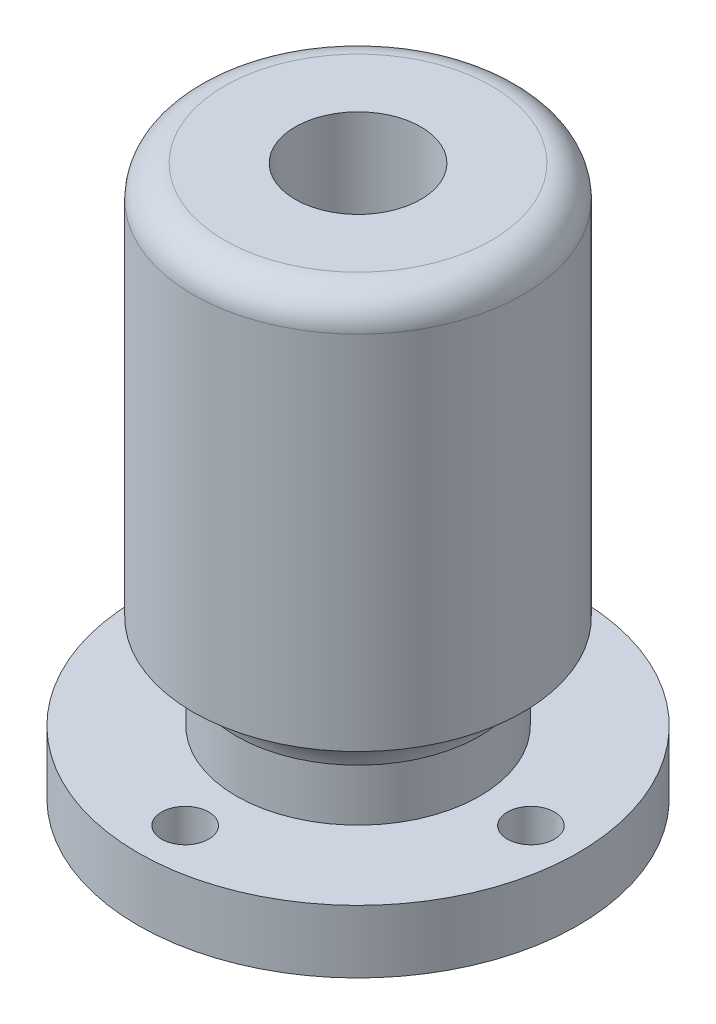
ISO-10303-21;
HEADER;
FILE_DESCRIPTION(('STEP AP214'),'2;1');
FILE_NAME('part.step','',(''),(''),'','','');
FILE_SCHEMA(('AUTOMOTIVE_DESIGN { 1 0 10303 214 1 1 1 1 }'));
ENDSEC;
DATA;
#1=APPLICATION_CONTEXT('core data for automotive mechanical design processes');
#2=APPLICATION_PROTOCOL_DEFINITION('international standard','automotive_design',2000,#1);
#3=PRODUCT_CONTEXT('',#1,'mechanical');
#4=PRODUCT('Part','Part','',(#3));
#5=PRODUCT_RELATED_PRODUCT_CATEGORY('part','',(#4));
#6=PRODUCT_DEFINITION_FORMATION('','',#4);
#7=PRODUCT_DEFINITION_CONTEXT('part definition',#1,'design');
#8=PRODUCT_DEFINITION('design','',#6,#7);
#9=PRODUCT_DEFINITION_SHAPE('','',#8);
#10=(LENGTH_UNIT() NAMED_UNIT(*) SI_UNIT(.MILLI.,.METRE.));
#11=(NAMED_UNIT(*) PLANE_ANGLE_UNIT() SI_UNIT($,.RADIAN.));
#12=(NAMED_UNIT(*) SI_UNIT($,.STERADIAN.) SOLID_ANGLE_UNIT());
#13=UNCERTAINTY_MEASURE_WITH_UNIT(LENGTH_MEASURE(1.E-05),#10,'distance_accuracy_value','');
#14=(GEOMETRIC_REPRESENTATION_CONTEXT(3) GLOBAL_UNCERTAINTY_ASSIGNED_CONTEXT((#13)) GLOBAL_UNIT_ASSIGNED_CONTEXT((#10,
#11,#12)) REPRESENTATION_CONTEXT('',''));
#15=CARTESIAN_POINT('',(0.,0.,0.));
#16=DIRECTION('',(0.,0.,1.));
#17=DIRECTION('',(1.,0.,0.));
#18=AXIS2_PLACEMENT_3D('',#15,#16,#17);
#19=CARTESIAN_POINT('',(0.,10.,0.));
#20=DIRECTION('',(0.,-1.,0.));
#21=DIRECTION('',(0.,0.,-1.));
#22=AXIS2_PLACEMENT_3D('',#19,#20,#21);
#23=CYLINDRICAL_SURFACE('',#22,7.75);
#24=CARTESIAN_POINT('',(0.,4.,0.));
#25=DIRECTION('',(0.,1.,0.));
#26=DIRECTION('',(0.,0.,1.));
#27=AXIS2_PLACEMENT_3D('',#24,#25,#26);
#28=CIRCLE('',#27,7.75);
#29=CARTESIAN_POINT('',(0.,4.,7.75));
#30=VERTEX_POINT('',#29);
#31=EDGE_CURVE('E81',#30,#30,#28,.T.);
#32=ORIENTED_EDGE('',*,*,#31,.T.);
#33=EDGE_LOOP('',(#32));
#34=FACE_BOUND('',#33,.T.);
#35=CARTESIAN_POINT('',(0.,7.30445931138069,0.));
#36=DIRECTION('',(0.,1.,0.));
#37=DIRECTION('',(0.,0.,1.));
#38=AXIS2_PLACEMENT_3D('',#35,#36,#37);
#39=CIRCLE('',#38,7.75);
#40=CARTESIAN_POINT('',(0.,7.30445931138069,7.75));
#41=VERTEX_POINT('',#40);
#42=EDGE_CURVE('E42',#41,#41,#39,.T.);
#43=ORIENTED_EDGE('',*,*,#42,.F.);
#44=EDGE_LOOP('',(#43));
#45=FACE_BOUND('',#44,.T.);
#46=ADVANCED_FACE('F31',(#34,#45),#23,.T.);
#47=CARTESIAN_POINT('',(0.,4.,0.));
#48=DIRECTION('',(0.,1.,0.));
#49=DIRECTION('',(0.,0.,1.));
#50=AXIS2_PLACEMENT_3D('',#47,#48,#49);
#51=PLANE('',#50);
#52=CARTESIAN_POINT('',(11.,4.,0.));
#53=DIRECTION('',(0.,1.,0.));
#54=DIRECTION('',(0.,0.,1.));
#55=AXIS2_PLACEMENT_3D('',#52,#53,#54);
#56=CIRCLE('',#55,1.5);
#57=CARTESIAN_POINT('',(11.,4.,1.5));
#58=VERTEX_POINT('',#57);
#59=EDGE_CURVE('E64',#58,#58,#56,.T.);
#60=ORIENTED_EDGE('',*,*,#59,.F.);
#61=EDGE_LOOP('',(#60));
#62=FACE_BOUND('',#61,.T.);
#63=CARTESIAN_POINT('',(0.,4.,-11.));
#64=DIRECTION('',(0.,1.,0.));
#65=DIRECTION('',(0.,0.,1.));
#66=AXIS2_PLACEMENT_3D('',#63,#64,#65);
#67=CIRCLE('',#66,1.5);
#68=CARTESIAN_POINT('',(0.,4.,-9.5));
#69=VERTEX_POINT('',#68);
#70=EDGE_CURVE('E52',#69,#69,#67,.T.);
#71=ORIENTED_EDGE('',*,*,#70,.F.);
#72=EDGE_LOOP('',(#71));
#73=FACE_BOUND('',#72,.T.);
#74=CARTESIAN_POINT('',(0.,4.,0.));
#75=DIRECTION('',(0.,1.,0.));
#76=DIRECTION('',(0.,0.,1.));
#77=AXIS2_PLACEMENT_3D('',#74,#75,#76);
#78=CIRCLE('',#77,14.);
#79=CARTESIAN_POINT('',(0.,4.,14.));
#80=VERTEX_POINT('',#79);
#81=EDGE_CURVE('E46',#80,#80,#78,.T.);
#82=ORIENTED_EDGE('',*,*,#81,.T.);
#83=EDGE_LOOP('',(#82));
#84=FACE_BOUND('',#83,.T.);
#85=CARTESIAN_POINT('',(0.,4.,11.));
#86=DIRECTION('',(0.,1.,0.));
#87=DIRECTION('',(0.,0.,1.));
#88=AXIS2_PLACEMENT_3D('',#85,#86,#87);
#89=CIRCLE('',#88,1.5);
#90=CARTESIAN_POINT('',(0.,4.,12.5));
#91=VERTEX_POINT('',#90);
#92=EDGE_CURVE('E58',#91,#91,#89,.T.);
#93=ORIENTED_EDGE('',*,*,#92,.F.);
#94=EDGE_LOOP('',(#93));
#95=FACE_BOUND('',#94,.T.);
#96=CARTESIAN_POINT('',(-11.,4.,0.));
#97=DIRECTION('',(0.,1.,0.));
#98=DIRECTION('',(0.,0.,1.));
#99=AXIS2_PLACEMENT_3D('',#96,#97,#98);
#100=CIRCLE('',#99,1.5);
#101=CARTESIAN_POINT('',(-11.,4.,1.5));
#102=VERTEX_POINT('',#101);
#103=EDGE_CURVE('E70',#102,#102,#100,.T.);
#104=ORIENTED_EDGE('',*,*,#103,.F.);
#105=EDGE_LOOP('',(#104));
#106=FACE_BOUND('',#105,.T.);
#107=ORIENTED_EDGE('',*,*,#31,.F.);
#108=EDGE_LOOP('',(#107));
#109=FACE_BOUND('',#108,.T.);
#110=ADVANCED_FACE('F108',(#62,#73,#84,#95,#106,#109),#51,.T.);
#111=CARTESIAN_POINT('',(0.,0.,0.));
#112=DIRECTION('',(0.,1.,0.));
#113=DIRECTION('',(0.,0.,1.));
#114=AXIS2_PLACEMENT_3D('',#111,#112,#113);
#115=PLANE('',#114);
#116=CARTESIAN_POINT('',(0.,0.,0.));
#117=DIRECTION('',(0.,1.,0.));
#118=DIRECTION('',(0.,0.,1.));
#119=AXIS2_PLACEMENT_3D('',#116,#117,#118);
#120=CIRCLE('',#119,14.);
#121=CARTESIAN_POINT('',(0.,0.,14.));
#122=VERTEX_POINT('',#121);
#123=EDGE_CURVE('E49',#122,#122,#120,.T.);
#124=ORIENTED_EDGE('',*,*,#123,.F.);
#125=EDGE_LOOP('',(#124));
#126=FACE_BOUND('',#125,.T.);
#127=CARTESIAN_POINT('',(0.,0.,-11.));
#128=DIRECTION('',(0.,1.,0.));
#129=DIRECTION('',(0.,0.,1.));
#130=AXIS2_PLACEMENT_3D('',#127,#128,#129);
#131=CIRCLE('',#130,1.5);
#132=CARTESIAN_POINT('',(0.,0.,-9.5));
#133=VERTEX_POINT('',#132);
#134=EDGE_CURVE('E55',#133,#133,#131,.T.);
#135=ORIENTED_EDGE('',*,*,#134,.T.);
#136=EDGE_LOOP('',(#135));
#137=FACE_BOUND('',#136,.T.);
#138=CARTESIAN_POINT('',(0.,0.,11.));
#139=DIRECTION('',(0.,1.,0.));
#140=DIRECTION('',(0.,0.,1.));
#141=AXIS2_PLACEMENT_3D('',#138,#139,#140);
#142=CIRCLE('',#141,1.5);
#143=CARTESIAN_POINT('',(0.,0.,12.5));
#144=VERTEX_POINT('',#143);
#145=EDGE_CURVE('E61',#144,#144,#142,.T.);
#146=ORIENTED_EDGE('',*,*,#145,.T.);
#147=EDGE_LOOP('',(#146));
#148=FACE_BOUND('',#147,.T.);
#149=CARTESIAN_POINT('',(11.,0.,0.));
#150=DIRECTION('',(0.,1.,0.));
#151=DIRECTION('',(0.,0.,1.));
#152=AXIS2_PLACEMENT_3D('',#149,#150,#151);
#153=CIRCLE('',#152,1.5);
#154=CARTESIAN_POINT('',(11.,0.,1.5));
#155=VERTEX_POINT('',#154);
#156=EDGE_CURVE('E67',#155,#155,#153,.T.);
#157=ORIENTED_EDGE('',*,*,#156,.T.);
#158=EDGE_LOOP('',(#157));
#159=FACE_BOUND('',#158,.T.);
#160=CARTESIAN_POINT('',(-11.,0.,0.));
#161=DIRECTION('',(0.,1.,0.));
#162=DIRECTION('',(0.,0.,1.));
#163=AXIS2_PLACEMENT_3D('',#160,#161,#162);
#164=CIRCLE('',#163,1.5);
#165=CARTESIAN_POINT('',(-11.,0.,1.5));
#166=VERTEX_POINT('',#165);
#167=EDGE_CURVE('E73',#166,#166,#164,.T.);
#168=ORIENTED_EDGE('',*,*,#167,.T.);
#169=EDGE_LOOP('',(#168));
#170=FACE_BOUND('',#169,.T.);
#171=CARTESIAN_POINT('',(0.,0.,0.));
#172=DIRECTION('',(0.,1.,0.));
#173=DIRECTION('',(0.,0.,1.));
#174=AXIS2_PLACEMENT_3D('',#171,#172,#173);
#175=CIRCLE('',#174,4.25);
#176=CARTESIAN_POINT('',(0.,0.,4.25));
#177=VERTEX_POINT('',#176);
#178=EDGE_CURVE('E76',#177,#177,#175,.T.);
#179=ORIENTED_EDGE('',*,*,#178,.T.);
#180=EDGE_LOOP('',(#179));
#181=FACE_BOUND('',#180,.T.);
#182=ADVANCED_FACE('F132',(#126,#137,#148,#159,#170,#181),#115,.F.);
#183=CARTESIAN_POINT('',(0.,4.,0.));
#184=DIRECTION('',(0.,-1.,0.));
#185=DIRECTION('',(0.,0.,-1.));
#186=AXIS2_PLACEMENT_3D('',#183,#184,#185);
#187=CYLINDRICAL_SURFACE('',#186,14.);
#188=ORIENTED_EDGE('',*,*,#81,.F.);
#189=EDGE_LOOP('',(#188));
#190=FACE_BOUND('',#189,.T.);
#191=ORIENTED_EDGE('',*,*,#123,.T.);
#192=EDGE_LOOP('',(#191));
#193=FACE_BOUND('',#192,.T.);
#194=ADVANCED_FACE('F128',(#190,#193),#187,.T.);
#195=CARTESIAN_POINT('',(0.,4.,-11.));
#196=DIRECTION('',(0.,-1.,0.));
#197=DIRECTION('',(0.,0.,-1.));
#198=AXIS2_PLACEMENT_3D('',#195,#196,#197);
#199=CYLINDRICAL_SURFACE('',#198,1.5);
#200=ORIENTED_EDGE('',*,*,#70,.T.);
#201=EDGE_LOOP('',(#200));
#202=FACE_BOUND('',#201,.T.);
#203=ORIENTED_EDGE('',*,*,#134,.F.);
#204=EDGE_LOOP('',(#203));
#205=FACE_BOUND('',#204,.T.);
#206=ADVANCED_FACE('F124',(#202,#205),#199,.F.);
#207=CARTESIAN_POINT('',(0.,4.,11.));
#208=DIRECTION('',(0.,-1.,0.));
#209=DIRECTION('',(0.,0.,-1.));
#210=AXIS2_PLACEMENT_3D('',#207,#208,#209);
#211=CYLINDRICAL_SURFACE('',#210,1.5);
#212=ORIENTED_EDGE('',*,*,#92,.T.);
#213=EDGE_LOOP('',(#212));
#214=FACE_BOUND('',#213,.T.);
#215=ORIENTED_EDGE('',*,*,#145,.F.);
#216=EDGE_LOOP('',(#215));
#217=FACE_BOUND('',#216,.T.);
#218=ADVANCED_FACE('F120',(#214,#217),#211,.F.);
#219=CARTESIAN_POINT('',(11.,4.,0.));
#220=DIRECTION('',(0.,-1.,0.));
#221=DIRECTION('',(0.,0.,-1.));
#222=AXIS2_PLACEMENT_3D('',#219,#220,#221);
#223=CYLINDRICAL_SURFACE('',#222,1.5);
#224=ORIENTED_EDGE('',*,*,#59,.T.);
#225=EDGE_LOOP('',(#224));
#226=FACE_BOUND('',#225,.T.);
#227=ORIENTED_EDGE('',*,*,#156,.F.);
#228=EDGE_LOOP('',(#227));
#229=FACE_BOUND('',#228,.T.);
#230=ADVANCED_FACE('F116',(#226,#229),#223,.F.);
#231=CARTESIAN_POINT('',(-11.,4.,0.));
#232=DIRECTION('',(0.,-1.,0.));
#233=DIRECTION('',(0.,0.,-1.));
#234=AXIS2_PLACEMENT_3D('',#231,#232,#233);
#235=CYLINDRICAL_SURFACE('',#234,1.5);
#236=ORIENTED_EDGE('',*,*,#103,.T.);
#237=EDGE_LOOP('',(#236));
#238=FACE_BOUND('',#237,.T.);
#239=ORIENTED_EDGE('',*,*,#167,.F.);
#240=EDGE_LOOP('',(#239));
#241=FACE_BOUND('',#240,.T.);
#242=ADVANCED_FACE('F112',(#238,#241),#235,.F.);
#243=CARTESIAN_POINT('',(0.,4.,0.));
#244=DIRECTION('',(0.,-1.,0.));
#245=DIRECTION('',(0.,0.,-1.));
#246=AXIS2_PLACEMENT_3D('',#243,#244,#245);
#247=CYLINDRICAL_SURFACE('',#246,4.25);
#248=ORIENTED_EDGE('',*,*,#178,.F.);
#249=EDGE_LOOP('',(#248));
#250=FACE_BOUND('',#249,.T.);
#251=CARTESIAN_POINT('',(0.,10.,0.));
#252=DIRECTION('',(0.,1.,0.));
#253=DIRECTION('',(0.,0.,1.));
#254=AXIS2_PLACEMENT_3D('',#251,#252,#253);
#255=CIRCLE('',#254,4.25);
#256=CARTESIAN_POINT('',(0.,10.,4.25));
#257=VERTEX_POINT('',#256);
#258=EDGE_CURVE('E87',#257,#257,#255,.T.);
#259=ORIENTED_EDGE('',*,*,#258,.T.);
#260=EDGE_LOOP('',(#259));
#261=FACE_BOUND('',#260,.T.);
#262=ADVANCED_FACE('F102',(#250,#261),#247,.F.);
#263=CARTESIAN_POINT('',(0.,7.30445931138069,-7.75));
#264=CARTESIAN_POINT('',(0.,9.50690322557724,-8.28922701631528));
#265=CARTESIAN_POINT('',(0.,10.,-10.5));
#266=B_SPLINE_CURVE_WITH_KNOTS('',2,(#263,#264,#265),.UNSPECIFIED.,.F.,.F.,(3,3),(0.,1.),.UNSPECIFIED.);
#267=CARTESIAN_POINT('',(0.,36.75,0.));
#268=DIRECTION('',(0.,1.,0.));
#269=AXIS1_PLACEMENT('',#267,#268);
#270=SURFACE_OF_REVOLUTION('',#266,#269);
#271=CARTESIAN_POINT('',(0.,10.,0.));
#272=DIRECTION('',(0.,1.,0.));
#273=DIRECTION('',(0.,0.,1.));
#274=AXIS2_PLACEMENT_3D('',#271,#272,#273);
#275=CIRCLE('',#274,10.5);
#276=CARTESIAN_POINT('',(0.,10.,10.5));
#277=VERTEX_POINT('',#276);
#278=EDGE_CURVE('E84',#277,#277,#275,.T.);
#279=ORIENTED_EDGE('',*,*,#278,.F.);
#280=EDGE_LOOP('',(#279));
#281=FACE_BOUND('',#280,.T.);
#282=ORIENTED_EDGE('',*,*,#42,.T.);
#283=EDGE_LOOP('',(#282));
#284=FACE_BOUND('',#283,.T.);
#285=ADVANCED_FACE('F97',(#281,#284),#270,.T.);
#286=CARTESIAN_POINT('',(0.,35.,0.));
#287=DIRECTION('',(0.,1.,0.));
#288=DIRECTION('',(0.,0.,1.));
#289=AXIS2_PLACEMENT_3D('',#286,#287,#288);
#290=PLANE('',#289);
#291=CARTESIAN_POINT('',(0.,35.,0.));
#292=DIRECTION('',(0.,1.,0.));
#293=DIRECTION('',(0.,0.,1.));
#294=AXIS2_PLACEMENT_3D('',#291,#292,#293);
#295=CIRCLE('',#294,8.5);
#296=CARTESIAN_POINT('',(0.,35.,8.5));
#297=VERTEX_POINT('',#296);
#298=EDGE_CURVE('E38',#297,#297,#295,.T.);
#299=ORIENTED_EDGE('',*,*,#298,.T.);
#300=EDGE_LOOP('',(#299));
#301=FACE_BOUND('',#300,.T.);
#302=CARTESIAN_POINT('',(0.,35.,0.));
#303=DIRECTION('',(0.,1.,0.));
#304=DIRECTION('',(0.,0.,1.));
#305=AXIS2_PLACEMENT_3D('',#302,#303,#304);
#306=CIRCLE('',#305,4.);
#307=CARTESIAN_POINT('',(0.,35.,4.));
#308=VERTEX_POINT('',#307);
#309=EDGE_CURVE('E157',#308,#308,#306,.T.);
#310=ORIENTED_EDGE('',*,*,#309,.F.);
#311=EDGE_LOOP('',(#310));
#312=FACE_BOUND('',#311,.T.);
#313=ADVANCED_FACE('F101',(#301,#312),#290,.T.);
#314=CARTESIAN_POINT('',(0.,10.,0.));
#315=DIRECTION('',(0.,1.,0.));
#316=DIRECTION('',(0.,0.,1.));
#317=AXIS2_PLACEMENT_3D('',#314,#315,#316);
#318=PLANE('',#317);
#319=ORIENTED_EDGE('',*,*,#258,.F.);
#320=EDGE_LOOP('',(#319));
#321=FACE_BOUND('',#320,.T.);
#322=CARTESIAN_POINT('',(0.,10.,0.));
#323=DIRECTION('',(0.,1.,0.));
#324=DIRECTION('',(0.,0.,1.));
#325=AXIS2_PLACEMENT_3D('',#322,#323,#324);
#326=CIRCLE('',#325,4.);
#327=CARTESIAN_POINT('',(0.,10.,4.));
#328=VERTEX_POINT('',#327);
#329=EDGE_CURVE('E159',#328,#328,#326,.T.);
#330=ORIENTED_EDGE('',*,*,#329,.T.);
#331=EDGE_LOOP('',(#330));
#332=FACE_BOUND('',#331,.T.);
#333=ADVANCED_FACE('F166',(#321,#332),#318,.F.);
#334=CARTESIAN_POINT('',(0.,35.,0.));
#335=DIRECTION('',(0.,-1.,0.));
#336=DIRECTION('',(0.,0.,-1.));
#337=AXIS2_PLACEMENT_3D('',#334,#335,#336);
#338=CYLINDRICAL_SURFACE('',#337,10.5);
#339=CARTESIAN_POINT('',(0.,33.,0.));
#340=DIRECTION('',(0.,1.,0.));
#341=DIRECTION('',(0.,0.,1.));
#342=AXIS2_PLACEMENT_3D('',#339,#340,#341);
#343=CIRCLE('',#342,10.5);
#344=CARTESIAN_POINT('',(0.,33.,10.5));
#345=VERTEX_POINT('',#344);
#346=EDGE_CURVE('E10',#345,#345,#343,.F.);
#347=ORIENTED_EDGE('',*,*,#346,.T.);
#348=EDGE_LOOP('',(#347));
#349=FACE_BOUND('',#348,.T.);
#350=ORIENTED_EDGE('',*,*,#278,.T.);
#351=EDGE_LOOP('',(#350));
#352=FACE_BOUND('',#351,.T.);
#353=ADVANCED_FACE('F104',(#349,#352),#338,.T.);
#354=CARTESIAN_POINT('',(0.,35.,0.));
#355=DIRECTION('',(0.,-1.,0.));
#356=DIRECTION('',(0.,0.,-1.));
#357=AXIS2_PLACEMENT_3D('',#354,#355,#356);
#358=CYLINDRICAL_SURFACE('',#357,4.);
#359=ORIENTED_EDGE('',*,*,#309,.T.);
#360=EDGE_LOOP('',(#359));
#361=FACE_BOUND('',#360,.T.);
#362=ORIENTED_EDGE('',*,*,#329,.F.);
#363=EDGE_LOOP('',(#362));
#364=FACE_BOUND('',#363,.T.);
#365=ADVANCED_FACE('F168',(#361,#364),#358,.F.);
#366=CARTESIAN_POINT('',(0.,33.,0.));
#367=DIRECTION('',(0.,1.,0.));
#368=DIRECTION('',(0.,0.,1.));
#369=AXIS2_PLACEMENT_3D('',#366,#367,#368);
#370=TOROIDAL_SURFACE('',#369,8.5,2.);
#371=ORIENTED_EDGE('',*,*,#346,.F.);
#372=EDGE_LOOP('',(#371));
#373=FACE_BOUND('',#372,.T.);
#374=ORIENTED_EDGE('',*,*,#298,.F.);
#375=EDGE_LOOP('',(#374));
#376=FACE_BOUND('',#375,.T.);
#377=ADVANCED_FACE('F33',(#373,#376),#370,.T.);
#378=CLOSED_SHELL('',(#46,#110,#182,#194,#206,#218,#230,#242,#262,#285,#313,#333,#353,#365,#377));
#379=MANIFOLD_SOLID_BREP('B2',#378);
#380=ADVANCED_BREP_SHAPE_REPRESENTATION('',(#18,#379),#14);
#381=SHAPE_DEFINITION_REPRESENTATION(#9,#380);
ENDSEC;
END-ISO-10303-21;
